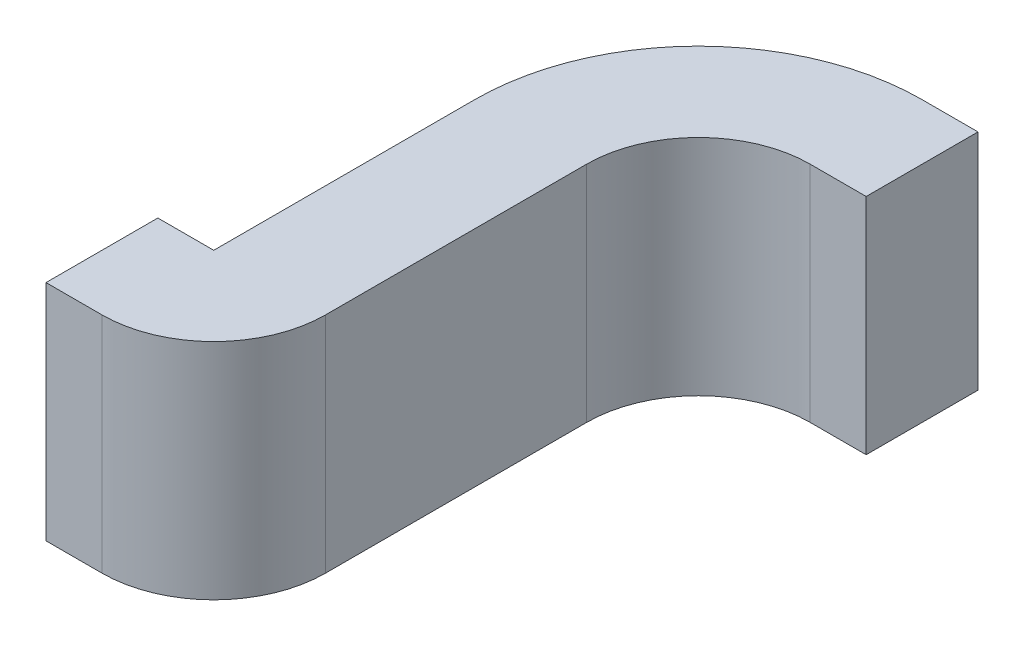
ISO-10303-21;
HEADER;
FILE_DESCRIPTION(('STEP AP214'),'2;1');
FILE_NAME('part.step','',(''),(''),'','','');
FILE_SCHEMA(('AUTOMOTIVE_DESIGN { 1 0 10303 214 1 1 1 1 }'));
ENDSEC;
DATA;
#1=APPLICATION_CONTEXT('core data for automotive mechanical design processes');
#2=APPLICATION_PROTOCOL_DEFINITION('international standard','automotive_design',2000,#1);
#3=PRODUCT_CONTEXT('',#1,'mechanical');
#4=PRODUCT('Part','Part','',(#3));
#5=PRODUCT_RELATED_PRODUCT_CATEGORY('part','',(#4));
#6=PRODUCT_DEFINITION_FORMATION('','',#4);
#7=PRODUCT_DEFINITION_CONTEXT('part definition',#1,'design');
#8=PRODUCT_DEFINITION('design','',#6,#7);
#9=PRODUCT_DEFINITION_SHAPE('','',#8);
#10=(LENGTH_UNIT() NAMED_UNIT(*) SI_UNIT(.MILLI.,.METRE.));
#11=(NAMED_UNIT(*) PLANE_ANGLE_UNIT() SI_UNIT($,.RADIAN.));
#12=(NAMED_UNIT(*) SI_UNIT($,.STERADIAN.) SOLID_ANGLE_UNIT());
#13=UNCERTAINTY_MEASURE_WITH_UNIT(LENGTH_MEASURE(1.E-05),#10,'distance_accuracy_value','');
#14=(GEOMETRIC_REPRESENTATION_CONTEXT(3) GLOBAL_UNCERTAINTY_ASSIGNED_CONTEXT((#13)) GLOBAL_UNIT_ASSIGNED_CONTEXT((#10,
#11,#12)) REPRESENTATION_CONTEXT('',''));
#15=CARTESIAN_POINT('',(0.,0.,0.));
#16=DIRECTION('',(0.,0.,1.));
#17=DIRECTION('',(1.,0.,0.));
#18=AXIS2_PLACEMENT_3D('',#15,#16,#17);
#19=CARTESIAN_POINT('',(0.925,0.15,0.8));
#20=DIRECTION('',(0.,0.,-1.));
#21=DIRECTION('',(1.,0.,0.));
#22=AXIS2_PLACEMENT_3D('',#19,#20,#21);
#23=PLANE('',#22);
#24=DIRECTION('',(0.,1.,0.));
#25=VECTOR('',#24,1.);
#26=CARTESIAN_POINT('',(0.85,0.15,0.8));
#27=LINE('',#26,#25);
#28=CARTESIAN_POINT('',(0.85,-0.15,0.8));
#29=VERTEX_POINT('',#28);
#30=CARTESIAN_POINT('',(0.85,0.15,0.8));
#31=VERTEX_POINT('',#30);
#32=EDGE_CURVE('E11',#29,#31,#27,.T.);
#33=ORIENTED_EDGE('',*,*,#32,.F.);
#34=DIRECTION('',(-1.,0.,0.));
#35=VECTOR('',#34,1.);
#36=CARTESIAN_POINT('',(0.925,-0.15,0.8));
#37=LINE('',#36,#35);
#38=CARTESIAN_POINT('',(0.925,-0.15,0.8));
#39=VERTEX_POINT('',#38);
#40=EDGE_CURVE('E24',#39,#29,#37,.T.);
#41=ORIENTED_EDGE('',*,*,#40,.F.);
#42=DIRECTION('',(0.,1.,0.));
#43=VECTOR('',#42,1.);
#44=CARTESIAN_POINT('',(0.925,0.15,0.8));
#45=LINE('',#44,#43);
#46=CARTESIAN_POINT('',(0.925,0.15,0.8));
#47=VERTEX_POINT('',#46);
#48=EDGE_CURVE('E183',#39,#47,#45,.T.);
#49=ORIENTED_EDGE('',*,*,#48,.T.);
#50=DIRECTION('',(-1.,0.,0.));
#51=VECTOR('',#50,1.);
#52=CARTESIAN_POINT('',(0.925,0.15,0.8));
#53=LINE('',#52,#51);
#54=EDGE_CURVE('E181',#47,#31,#53,.T.);
#55=ORIENTED_EDGE('',*,*,#54,.T.);
#56=EDGE_LOOP('',(#33,#41,#49,#55));
#57=FACE_BOUND('',#56,.T.);
#58=ADVANCED_FACE('F17',(#57),#23,.F.);
#59=CARTESIAN_POINT('',(0.925,-0.15,0.65));
#60=DIRECTION('',(0.,1.,0.));
#61=DIRECTION('',(0.,0.,1.));
#62=AXIS2_PLACEMENT_3D('',#59,#60,#61);
#63=PLANE('',#62);
#64=DIRECTION('',(0.,0.,1.));
#65=VECTOR('',#64,1.);
#66=CARTESIAN_POINT('',(0.85,-0.15,0.65));
#67=LINE('',#66,#65);
#68=CARTESIAN_POINT('',(0.85,-0.15,0.65));
#69=VERTEX_POINT('',#68);
#70=EDGE_CURVE('E179',#69,#29,#67,.T.);
#71=ORIENTED_EDGE('',*,*,#70,.F.);
#72=DIRECTION('',(-1.,0.,0.));
#73=VECTOR('',#72,1.);
#74=CARTESIAN_POINT('',(0.925,-0.15,0.65));
#75=LINE('',#74,#73);
#76=CARTESIAN_POINT('',(0.925,-0.15,0.65));
#77=VERTEX_POINT('',#76);
#78=EDGE_CURVE('E177',#77,#69,#75,.T.);
#79=ORIENTED_EDGE('',*,*,#78,.F.);
#80=DIRECTION('',(0.,0.,-1.));
#81=VECTOR('',#80,1.);
#82=CARTESIAN_POINT('',(0.925,-0.15,0.65));
#83=LINE('',#82,#81);
#84=CARTESIAN_POINT('',(0.925,-0.15,0.3));
#85=VERTEX_POINT('',#84);
#86=EDGE_CURVE('E119',#77,#85,#83,.T.);
#87=ORIENTED_EDGE('',*,*,#86,.T.);
#88=CARTESIAN_POINT('',(1.225,-0.15,0.3));
#89=DIRECTION('',(0.,-1.,0.));
#90=DIRECTION('',(0.,0.,1.));
#91=AXIS2_PLACEMENT_3D('',#88,#89,#90);
#92=CIRCLE('',#91,0.299999999999999);
#93=CARTESIAN_POINT('',(1.225,-0.15,0.));
#94=VERTEX_POINT('',#93);
#95=EDGE_CURVE('E174',#85,#94,#92,.T.);
#96=ORIENTED_EDGE('',*,*,#95,.T.);
#97=DIRECTION('',(1.,0.,0.));
#98=VECTOR('',#97,1.);
#99=CARTESIAN_POINT('',(1.225,-0.15,0.));
#100=LINE('',#99,#98);
#101=CARTESIAN_POINT('',(1.3,-0.15,0.));
#102=VERTEX_POINT('',#101);
#103=EDGE_CURVE('E172',#94,#102,#100,.T.);
#104=ORIENTED_EDGE('',*,*,#103,.T.);
#105=DIRECTION('',(0.,0.,1.));
#106=VECTOR('',#105,1.);
#107=CARTESIAN_POINT('',(1.3,-0.15,0.));
#108=LINE('',#107,#106);
#109=CARTESIAN_POINT('',(1.3,-0.15,0.15));
#110=VERTEX_POINT('',#109);
#111=EDGE_CURVE('E170',#102,#110,#108,.T.);
#112=ORIENTED_EDGE('',*,*,#111,.T.);
#113=DIRECTION('',(1.,0.,0.));
#114=VECTOR('',#113,1.);
#115=CARTESIAN_POINT('',(1.225,-0.15,0.15));
#116=LINE('',#115,#114);
#117=CARTESIAN_POINT('',(1.225,-0.15,0.15));
#118=VERTEX_POINT('',#117);
#119=EDGE_CURVE('E167',#118,#110,#116,.T.);
#120=ORIENTED_EDGE('',*,*,#119,.F.);
#121=CARTESIAN_POINT('',(1.225,-0.15,0.3));
#122=DIRECTION('',(0.,-1.,0.));
#123=DIRECTION('',(0.,0.,1.));
#124=AXIS2_PLACEMENT_3D('',#121,#122,#123);
#125=CIRCLE('',#124,0.15);
#126=CARTESIAN_POINT('',(1.075,-0.15,0.3));
#127=VERTEX_POINT('',#126);
#128=EDGE_CURVE('E164',#127,#118,#125,.T.);
#129=ORIENTED_EDGE('',*,*,#128,.F.);
#130=DIRECTION('',(0.,0.,-1.));
#131=VECTOR('',#130,1.);
#132=CARTESIAN_POINT('',(1.075,-0.15,0.649999999999999));
#133=LINE('',#132,#131);
#134=CARTESIAN_POINT('',(1.075,-0.15,0.649999999999999));
#135=VERTEX_POINT('',#134);
#136=EDGE_CURVE('E161',#135,#127,#133,.T.);
#137=ORIENTED_EDGE('',*,*,#136,.F.);
#138=CARTESIAN_POINT('',(0.925,-0.15,0.65));
#139=DIRECTION('',(0.,1.,0.));
#140=DIRECTION('',(0.,0.,-1.));
#141=AXIS2_PLACEMENT_3D('',#138,#139,#140);
#142=CIRCLE('',#141,0.15);
#143=EDGE_CURVE('E158',#39,#135,#142,.T.);
#144=ORIENTED_EDGE('',*,*,#143,.F.);
#145=ORIENTED_EDGE('',*,*,#40,.T.);
#146=EDGE_LOOP('',(#71,#79,#87,#96,#104,#112,#120,#129,#137,#144,#145));
#147=FACE_BOUND('',#146,.T.);
#148=ADVANCED_FACE('F186',(#147),#63,.F.);
#149=CARTESIAN_POINT('',(0.925,0.15,0.65));
#150=DIRECTION('',(0.,-1.,0.));
#151=DIRECTION('',(0.,0.,-1.));
#152=AXIS2_PLACEMENT_3D('',#149,#150,#151);
#153=PLANE('',#152);
#154=DIRECTION('',(0.,0.,-1.));
#155=VECTOR('',#154,1.);
#156=CARTESIAN_POINT('',(0.85,0.15,0.65));
#157=LINE('',#156,#155);
#158=CARTESIAN_POINT('',(0.85,0.15,0.65));
#159=VERTEX_POINT('',#158);
#160=EDGE_CURVE('E156',#31,#159,#157,.T.);
#161=ORIENTED_EDGE('',*,*,#160,.F.);
#162=ORIENTED_EDGE('',*,*,#54,.F.);
#163=CARTESIAN_POINT('',(0.925,0.15,0.65));
#164=DIRECTION('',(0.,1.,0.));
#165=DIRECTION('',(0.,0.,-1.));
#166=AXIS2_PLACEMENT_3D('',#163,#164,#165);
#167=CIRCLE('',#166,0.15);
#168=CARTESIAN_POINT('',(1.075,0.15,0.649999999999999));
#169=VERTEX_POINT('',#168);
#170=EDGE_CURVE('E154',#47,#169,#167,.T.);
#171=ORIENTED_EDGE('',*,*,#170,.T.);
#172=DIRECTION('',(0.,0.,-1.));
#173=VECTOR('',#172,1.);
#174=CARTESIAN_POINT('',(1.075,0.15,0.649999999999999));
#175=LINE('',#174,#173);
#176=CARTESIAN_POINT('',(1.075,0.15,0.3));
#177=VERTEX_POINT('',#176);
#178=EDGE_CURVE('E152',#169,#177,#175,.T.);
#179=ORIENTED_EDGE('',*,*,#178,.T.);
#180=CARTESIAN_POINT('',(1.225,0.15,0.3));
#181=DIRECTION('',(0.,-1.,0.));
#182=DIRECTION('',(0.,0.,1.));
#183=AXIS2_PLACEMENT_3D('',#180,#181,#182);
#184=CIRCLE('',#183,0.15);
#185=CARTESIAN_POINT('',(1.225,0.15,0.15));
#186=VERTEX_POINT('',#185);
#187=EDGE_CURVE('E150',#177,#186,#184,.T.);
#188=ORIENTED_EDGE('',*,*,#187,.T.);
#189=DIRECTION('',(1.,0.,0.));
#190=VECTOR('',#189,1.);
#191=CARTESIAN_POINT('',(1.225,0.15,0.15));
#192=LINE('',#191,#190);
#193=CARTESIAN_POINT('',(1.3,0.15,0.15));
#194=VERTEX_POINT('',#193);
#195=EDGE_CURVE('E148',#186,#194,#192,.T.);
#196=ORIENTED_EDGE('',*,*,#195,.T.);
#197=DIRECTION('',(0.,0.,-1.));
#198=VECTOR('',#197,1.);
#199=CARTESIAN_POINT('',(1.3,0.15,0.));
#200=LINE('',#199,#198);
#201=CARTESIAN_POINT('',(1.3,0.15,0.));
#202=VERTEX_POINT('',#201);
#203=EDGE_CURVE('E146',#194,#202,#200,.T.);
#204=ORIENTED_EDGE('',*,*,#203,.T.);
#205=DIRECTION('',(1.,0.,0.));
#206=VECTOR('',#205,1.);
#207=CARTESIAN_POINT('',(1.225,0.15,0.));
#208=LINE('',#207,#206);
#209=CARTESIAN_POINT('',(1.225,0.15,0.));
#210=VERTEX_POINT('',#209);
#211=EDGE_CURVE('E143',#210,#202,#208,.T.);
#212=ORIENTED_EDGE('',*,*,#211,.F.);
#213=CARTESIAN_POINT('',(1.225,0.15,0.3));
#214=DIRECTION('',(0.,-1.,0.));
#215=DIRECTION('',(0.,0.,1.));
#216=AXIS2_PLACEMENT_3D('',#213,#214,#215);
#217=CIRCLE('',#216,0.299999999999999);
#218=CARTESIAN_POINT('',(0.925,0.15,0.3));
#219=VERTEX_POINT('',#218);
#220=EDGE_CURVE('E102',#219,#210,#217,.T.);
#221=ORIENTED_EDGE('',*,*,#220,.F.);
#222=DIRECTION('',(0.,0.,-1.));
#223=VECTOR('',#222,1.);
#224=CARTESIAN_POINT('',(0.925,0.15,0.65));
#225=LINE('',#224,#223);
#226=CARTESIAN_POINT('',(0.925,0.15,0.65));
#227=VERTEX_POINT('',#226);
#228=EDGE_CURVE('E95',#227,#219,#225,.T.);
#229=ORIENTED_EDGE('',*,*,#228,.F.);
#230=DIRECTION('',(-1.,0.,0.));
#231=VECTOR('',#230,1.);
#232=CARTESIAN_POINT('',(0.925,0.15,0.65));
#233=LINE('',#232,#231);
#234=EDGE_CURVE('E99',#227,#159,#233,.T.);
#235=ORIENTED_EDGE('',*,*,#234,.T.);
#236=EDGE_LOOP('',(#161,#162,#171,#179,#188,#196,#204,#212,#221,#229,#235));
#237=FACE_BOUND('',#236,.T.);
#238=ADVANCED_FACE('F98',(#237),#153,.F.);
#239=CARTESIAN_POINT('',(0.925,0.,0.65));
#240=DIRECTION('',(0.,-1.,0.));
#241=DIRECTION('',(0.,0.,-1.));
#242=AXIS2_PLACEMENT_3D('',#239,#240,#241);
#243=CYLINDRICAL_SURFACE('',#242,0.15);
#244=ORIENTED_EDGE('',*,*,#48,.F.);
#245=ORIENTED_EDGE('',*,*,#143,.T.);
#246=DIRECTION('',(0.,1.,0.));
#247=VECTOR('',#246,1.);
#248=CARTESIAN_POINT('',(1.075,0.15,0.649999999999999));
#249=LINE('',#248,#247);
#250=EDGE_CURVE('E115',#135,#169,#249,.T.);
#251=ORIENTED_EDGE('',*,*,#250,.T.);
#252=ORIENTED_EDGE('',*,*,#170,.F.);
#253=EDGE_LOOP('',(#244,#245,#251,#252));
#254=FACE_BOUND('',#253,.T.);
#255=ADVANCED_FACE('F193',(#254),#243,.T.);
#256=CARTESIAN_POINT('',(0.85,-0.15,0.65));
#257=DIRECTION('',(1.,0.,0.));
#258=DIRECTION('',(0.,0.,1.));
#259=AXIS2_PLACEMENT_3D('',#256,#257,#258);
#260=PLANE('',#259);
#261=DIRECTION('',(0.,-1.,0.));
#262=VECTOR('',#261,1.);
#263=CARTESIAN_POINT('',(0.85,0.15,0.65));
#264=LINE('',#263,#262);
#265=EDGE_CURVE('E114',#159,#69,#264,.T.);
#266=ORIENTED_EDGE('',*,*,#265,.T.);
#267=ORIENTED_EDGE('',*,*,#70,.T.);
#268=ORIENTED_EDGE('',*,*,#32,.T.);
#269=ORIENTED_EDGE('',*,*,#160,.T.);
#270=EDGE_LOOP('',(#266,#267,#268,#269));
#271=FACE_BOUND('',#270,.T.);
#272=ADVANCED_FACE('F188',(#271),#260,.F.);
#273=CARTESIAN_POINT('',(1.225,0.,0.3));
#274=DIRECTION('',(0.,1.,0.));
#275=DIRECTION('',(0.,0.,1.));
#276=AXIS2_PLACEMENT_3D('',#273,#274,#275);
#277=CYLINDRICAL_SURFACE('',#276,0.15);
#278=DIRECTION('',(0.,1.,0.));
#279=VECTOR('',#278,1.);
#280=CARTESIAN_POINT('',(1.075,0.15,0.3));
#281=LINE('',#280,#279);
#282=EDGE_CURVE('E136',#127,#177,#281,.T.);
#283=ORIENTED_EDGE('',*,*,#282,.F.);
#284=ORIENTED_EDGE('',*,*,#128,.T.);
#285=DIRECTION('',(0.,1.,0.));
#286=VECTOR('',#285,1.);
#287=CARTESIAN_POINT('',(1.225,0.15,0.15));
#288=LINE('',#287,#286);
#289=EDGE_CURVE('E133',#118,#186,#288,.T.);
#290=ORIENTED_EDGE('',*,*,#289,.T.);
#291=ORIENTED_EDGE('',*,*,#187,.F.);
#292=EDGE_LOOP('',(#283,#284,#290,#291));
#293=FACE_BOUND('',#292,.T.);
#294=ADVANCED_FACE('F201',(#293),#277,.F.);
#295=CARTESIAN_POINT('',(1.3,-0.15,0.));
#296=DIRECTION('',(1.,0.,0.));
#297=DIRECTION('',(0.,0.,1.));
#298=AXIS2_PLACEMENT_3D('',#295,#296,#297);
#299=PLANE('',#298);
#300=DIRECTION('',(0.,-1.,0.));
#301=VECTOR('',#300,1.);
#302=CARTESIAN_POINT('',(1.3,0.15,0.));
#303=LINE('',#302,#301);
#304=EDGE_CURVE('E130',#202,#102,#303,.T.);
#305=ORIENTED_EDGE('',*,*,#304,.F.);
#306=ORIENTED_EDGE('',*,*,#203,.F.);
#307=DIRECTION('',(0.,1.,0.));
#308=VECTOR('',#307,1.);
#309=CARTESIAN_POINT('',(1.3,0.15,0.15));
#310=LINE('',#309,#308);
#311=EDGE_CURVE('E124',#110,#194,#310,.T.);
#312=ORIENTED_EDGE('',*,*,#311,.F.);
#313=ORIENTED_EDGE('',*,*,#111,.F.);
#314=EDGE_LOOP('',(#305,#306,#312,#313));
#315=FACE_BOUND('',#314,.T.);
#316=ADVANCED_FACE('F209',(#315),#299,.T.);
#317=CARTESIAN_POINT('',(1.225,0.15,0.));
#318=DIRECTION('',(0.,0.,-1.));
#319=DIRECTION('',(1.,0.,0.));
#320=AXIS2_PLACEMENT_3D('',#317,#318,#319);
#321=PLANE('',#320);
#322=DIRECTION('',(0.,-1.,0.));
#323=VECTOR('',#322,1.);
#324=CARTESIAN_POINT('',(1.225,0.15,0.));
#325=LINE('',#324,#323);
#326=EDGE_CURVE('E120',#210,#94,#325,.T.);
#327=ORIENTED_EDGE('',*,*,#326,.F.);
#328=ORIENTED_EDGE('',*,*,#211,.T.);
#329=ORIENTED_EDGE('',*,*,#304,.T.);
#330=ORIENTED_EDGE('',*,*,#103,.F.);
#331=EDGE_LOOP('',(#327,#328,#329,#330));
#332=FACE_BOUND('',#331,.T.);
#333=ADVANCED_FACE('F214',(#332),#321,.T.);
#334=CARTESIAN_POINT('',(1.225,0.15,0.15));
#335=DIRECTION('',(0.,0.,1.));
#336=DIRECTION('',(-1.,0.,0.));
#337=AXIS2_PLACEMENT_3D('',#334,#335,#336);
#338=PLANE('',#337);
#339=ORIENTED_EDGE('',*,*,#289,.F.);
#340=ORIENTED_EDGE('',*,*,#119,.T.);
#341=ORIENTED_EDGE('',*,*,#311,.T.);
#342=ORIENTED_EDGE('',*,*,#195,.F.);
#343=EDGE_LOOP('',(#339,#340,#341,#342));
#344=FACE_BOUND('',#343,.T.);
#345=ADVANCED_FACE('F204',(#344),#338,.T.);
#346=CARTESIAN_POINT('',(1.075,0.15,0.65));
#347=DIRECTION('',(1.,0.,0.));
#348=DIRECTION('',(0.,0.,1.));
#349=AXIS2_PLACEMENT_3D('',#346,#347,#348);
#350=PLANE('',#349);
#351=ORIENTED_EDGE('',*,*,#250,.F.);
#352=ORIENTED_EDGE('',*,*,#136,.T.);
#353=ORIENTED_EDGE('',*,*,#282,.T.);
#354=ORIENTED_EDGE('',*,*,#178,.F.);
#355=EDGE_LOOP('',(#351,#352,#353,#354));
#356=FACE_BOUND('',#355,.T.);
#357=ADVANCED_FACE('F196',(#356),#350,.T.);
#358=CARTESIAN_POINT('',(0.925,0.15,0.65));
#359=DIRECTION('',(-1.,0.,0.));
#360=DIRECTION('',(0.,0.,-1.));
#361=AXIS2_PLACEMENT_3D('',#358,#359,#360);
#362=PLANE('',#361);
#363=DIRECTION('',(0.,-1.,0.));
#364=VECTOR('',#363,1.);
#365=CARTESIAN_POINT('',(0.925,0.15,0.65));
#366=LINE('',#365,#364);
#367=EDGE_CURVE('E112',#227,#77,#366,.T.);
#368=ORIENTED_EDGE('',*,*,#367,.F.);
#369=ORIENTED_EDGE('',*,*,#228,.T.);
#370=DIRECTION('',(0.,-1.,0.));
#371=VECTOR('',#370,1.);
#372=CARTESIAN_POINT('',(0.925,0.15,0.3));
#373=LINE('',#372,#371);
#374=EDGE_CURVE('E121',#219,#85,#373,.T.);
#375=ORIENTED_EDGE('',*,*,#374,.T.);
#376=ORIENTED_EDGE('',*,*,#86,.F.);
#377=EDGE_LOOP('',(#368,#369,#375,#376));
#378=FACE_BOUND('',#377,.T.);
#379=ADVANCED_FACE('F118',(#378),#362,.T.);
#380=CARTESIAN_POINT('',(0.925,0.15,0.65));
#381=DIRECTION('',(0.,0.,1.));
#382=DIRECTION('',(-1.,0.,0.));
#383=AXIS2_PLACEMENT_3D('',#380,#381,#382);
#384=PLANE('',#383);
#385=ORIENTED_EDGE('',*,*,#265,.F.);
#386=ORIENTED_EDGE('',*,*,#234,.F.);
#387=ORIENTED_EDGE('',*,*,#367,.T.);
#388=ORIENTED_EDGE('',*,*,#78,.T.);
#389=EDGE_LOOP('',(#385,#386,#387,#388));
#390=FACE_BOUND('',#389,.T.);
#391=ADVANCED_FACE('F110',(#390),#384,.F.);
#392=CARTESIAN_POINT('',(1.225,0.,0.3));
#393=DIRECTION('',(0.,1.,0.));
#394=DIRECTION('',(0.,0.,1.));
#395=AXIS2_PLACEMENT_3D('',#392,#393,#394);
#396=CYLINDRICAL_SURFACE('',#395,0.299999999999999);
#397=ORIENTED_EDGE('',*,*,#374,.F.);
#398=ORIENTED_EDGE('',*,*,#220,.T.);
#399=ORIENTED_EDGE('',*,*,#326,.T.);
#400=ORIENTED_EDGE('',*,*,#95,.F.);
#401=EDGE_LOOP('',(#397,#398,#399,#400));
#402=FACE_BOUND('',#401,.T.);
#403=ADVANCED_FACE('F216',(#402),#396,.T.);
#404=CLOSED_SHELL('',(#58,#148,#238,#255,#272,#294,#316,#333,#345,#357,#379,#391,#403));
#405=MANIFOLD_SOLID_BREP('B1',#404);
#406=ADVANCED_BREP_SHAPE_REPRESENTATION('',(#18,#405),#14);
#407=SHAPE_DEFINITION_REPRESENTATION(#9,#406);
ENDSEC;
END-ISO-10303-21;
